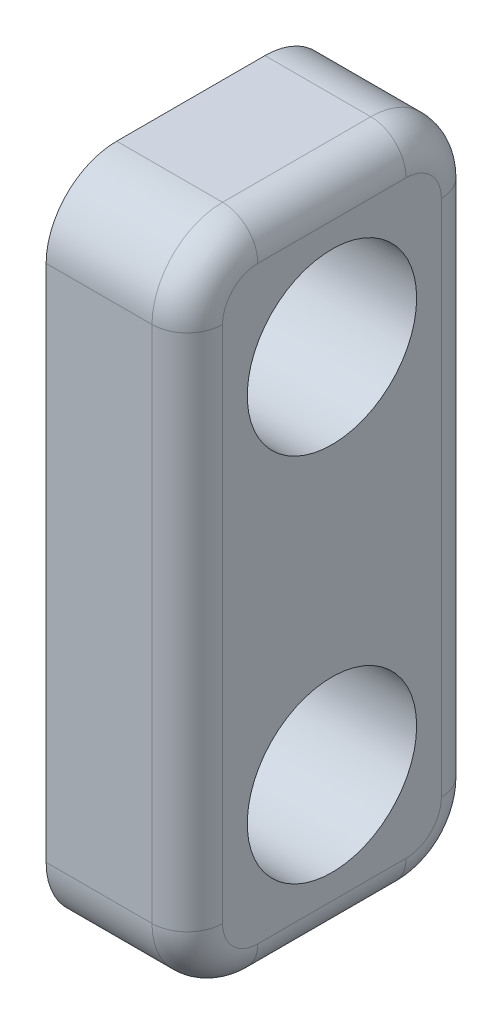
ISO-10303-21;
HEADER;
FILE_DESCRIPTION(('STEP AP214'),'2;1');
FILE_NAME('part.step','',(''),(''),'','','');
FILE_SCHEMA(('AUTOMOTIVE_DESIGN { 1 0 10303 214 1 1 1 1 }'));
ENDSEC;
DATA;
#1=APPLICATION_CONTEXT('core data for automotive mechanical design processes');
#2=APPLICATION_PROTOCOL_DEFINITION('international standard','automotive_design',2000,#1);
#3=PRODUCT_CONTEXT('',#1,'mechanical');
#4=PRODUCT('Part','Part','',(#3));
#5=PRODUCT_RELATED_PRODUCT_CATEGORY('part','',(#4));
#6=PRODUCT_DEFINITION_FORMATION('','',#4);
#7=PRODUCT_DEFINITION_CONTEXT('part definition',#1,'design');
#8=PRODUCT_DEFINITION('design','',#6,#7);
#9=PRODUCT_DEFINITION_SHAPE('','',#8);
#10=(LENGTH_UNIT() NAMED_UNIT(*) SI_UNIT(.MILLI.,.METRE.));
#11=(NAMED_UNIT(*) PLANE_ANGLE_UNIT() SI_UNIT($,.RADIAN.));
#12=(NAMED_UNIT(*) SI_UNIT($,.STERADIAN.) SOLID_ANGLE_UNIT());
#13=UNCERTAINTY_MEASURE_WITH_UNIT(LENGTH_MEASURE(1.E-05),#10,'distance_accuracy_value','');
#14=(GEOMETRIC_REPRESENTATION_CONTEXT(3) GLOBAL_UNCERTAINTY_ASSIGNED_CONTEXT((#13)) GLOBAL_UNIT_ASSIGNED_CONTEXT((#10,
#11,#12)) REPRESENTATION_CONTEXT('',''));
#15=CARTESIAN_POINT('',(0.,0.,0.));
#16=DIRECTION('',(0.,0.,1.));
#17=DIRECTION('',(1.,0.,0.));
#18=AXIS2_PLACEMENT_3D('',#15,#16,#17);
#19=CARTESIAN_POINT('',(-69.0290957761398,135.89197650815,0.442740883651495));
#20=DIRECTION('',(-1.,0.,-2.08166817117215E-13));
#21=DIRECTION('',(-2.08166817117215E-13,0.,1.));
#22=AXIS2_PLACEMENT_3D('',#19,#20,#21);
#23=TOROIDAL_SURFACE('',#22,1.00000000000001,0.99999999999995);
#24=CARTESIAN_POINT('',(-69.0290957761398,135.89197650815,0.442740883651457));
#25=DIRECTION('',(1.,0.,2.4757973449141E-13));
#26=DIRECTION('',(2.4757973449141E-13,0.,-1.));
#27=AXIS2_PLACEMENT_3D('',#24,#25,#26);
#28=CIRCLE('',#27,2.);
#29=CARTESIAN_POINT('',(-69.0290957761403,135.89197650815,2.44274088365146));
#30=VERTEX_POINT('',#29);
#31=CARTESIAN_POINT('',(-69.0290957761399,137.89197650815,0.442740883651085));
#32=VERTEX_POINT('',#31);
#33=EDGE_CURVE('E130',#30,#32,#28,.F.);
#34=ORIENTED_EDGE('',*,*,#33,.F.);
#35=CARTESIAN_POINT('',(-69.0290957761401,135.89197650815,1.44274088365146));
#36=DIRECTION('',(0.,-1.,0.));
#37=DIRECTION('',(1.,0.,0.));
#38=AXIS2_PLACEMENT_3D('',#35,#36,#37);
#39=CIRCLE('',#38,1.);
#40=CARTESIAN_POINT('',(-68.0290957761401,135.89197650815,1.4427408836517));
#41=VERTEX_POINT('',#40);
#42=EDGE_CURVE('E85',#41,#30,#39,.T.);
#43=ORIENTED_EDGE('',*,*,#42,.F.);
#44=CARTESIAN_POINT('',(-68.0290957761399,135.89197650815,0.442740883651703));
#45=DIRECTION('',(-1.,0.,-2.08166817117215E-13));
#46=DIRECTION('',(-2.08166817117215E-13,0.,1.));
#47=AXIS2_PLACEMENT_3D('',#44,#45,#46);
#48=CIRCLE('',#47,1.00000000000001);
#49=CARTESIAN_POINT('',(-68.0290957761399,136.89197650815,0.442740883651703));
#50=VERTEX_POINT('',#49);
#51=EDGE_CURVE('E21',#41,#50,#48,.T.);
#52=ORIENTED_EDGE('',*,*,#51,.T.);
#53=CARTESIAN_POINT('',(-69.0290957761399,136.89197650815,0.442740883651455));
#54=DIRECTION('',(-2.47817639425388E-13,0.,1.));
#55=DIRECTION('',(1.,0.,2.47817639425388E-13));
#56=AXIS2_PLACEMENT_3D('',#53,#54,#55);
#57=CIRCLE('',#56,1.);
#58=EDGE_CURVE('E90',#32,#50,#57,.F.);
#59=ORIENTED_EDGE('',*,*,#58,.F.);
#60=EDGE_LOOP('',(#34,#43,#52,#59));
#61=FACE_BOUND('',#60,.T.);
#62=ADVANCED_FACE('F17',(#61),#23,.T.);
#63=CARTESIAN_POINT('',(-69.029095776138,136.89197650815,-7.11415980814186));
#64=DIRECTION('',(-2.47817639425388E-13,0.,1.));
#65=DIRECTION('',(1.,0.,2.47817639425388E-13));
#66=AXIS2_PLACEMENT_3D('',#63,#64,#65);
#67=CYLINDRICAL_SURFACE('',#66,1.);
#68=ORIENTED_EDGE('',*,*,#58,.T.);
#69=DIRECTION('',(-2.47817639425388E-13,0.,1.));
#70=VECTOR('',#69,1.);
#71=CARTESIAN_POINT('',(-68.0290957761377,136.89197650815,-8.47106049993493));
#72=LINE('',#71,#70);
#73=CARTESIAN_POINT('',(-68.0290957761388,136.89197650815,-3.7572591163483));
#74=VERTEX_POINT('',#73);
#75=EDGE_CURVE('E95',#50,#74,#72,.F.);
#76=ORIENTED_EDGE('',*,*,#75,.T.);
#77=CARTESIAN_POINT('',(-69.0290957761388,136.89197650815,-3.75725911634855));
#78=DIRECTION('',(-2.4980018054066E-13,0.,1.));
#79=DIRECTION('',(1.,0.,2.4980018054066E-13));
#80=AXIS2_PLACEMENT_3D('',#77,#78,#79);
#81=CIRCLE('',#80,1.00000000000001);
#82=CARTESIAN_POINT('',(-69.0290957761391,137.89197650815,-3.75725911634855));
#83=VERTEX_POINT('',#82);
#84=EDGE_CURVE('E104',#74,#83,#81,.T.);
#85=ORIENTED_EDGE('',*,*,#84,.T.);
#86=DIRECTION('',(0.,0.,1.));
#87=VECTOR('',#86,1.);
#88=CARTESIAN_POINT('',(-69.0290957761399,137.89197650815,-5.75725911634929));
#89=LINE('',#88,#87);
#90=EDGE_CURVE('E102',#32,#83,#89,.F.);
#91=ORIENTED_EDGE('',*,*,#90,.F.);
#92=EDGE_LOOP('',(#68,#76,#85,#91));
#93=FACE_BOUND('',#92,.T.);
#94=ADVANCED_FACE('F98',(#93),#67,.T.);
#95=CARTESIAN_POINT('',(-69.0290957761387,135.89197650815,-3.75725911634849));
#96=DIRECTION('',(-1.,0.,-1.94289029309402E-13));
#97=DIRECTION('',(-1.94289029309402E-13,0.,1.));
#98=AXIS2_PLACEMENT_3D('',#95,#96,#97);
#99=TOROIDAL_SURFACE('',#98,1.00000000000008,1.00000000000001);
#100=CARTESIAN_POINT('',(-69.0290957761388,135.89197650815,-3.75725911634855));
#101=DIRECTION('',(1.,0.,2.4757973449141E-13));
#102=DIRECTION('',(2.4757973449141E-13,0.,-1.));
#103=AXIS2_PLACEMENT_3D('',#100,#101,#102);
#104=CIRCLE('',#103,2.);
#105=CARTESIAN_POINT('',(-69.0290957761383,135.89197650815,-5.75725911634855));
#106=VERTEX_POINT('',#105);
#107=EDGE_CURVE('E175',#83,#106,#104,.F.);
#108=ORIENTED_EDGE('',*,*,#107,.F.);
#109=ORIENTED_EDGE('',*,*,#84,.F.);
#110=CARTESIAN_POINT('',(-68.0290957761387,135.89197650815,-3.7572591163483));
#111=DIRECTION('',(-1.,0.,-1.94289029309402E-13));
#112=DIRECTION('',(-1.94289029309402E-13,0.,1.));
#113=AXIS2_PLACEMENT_3D('',#110,#111,#112);
#114=CIRCLE('',#113,0.999999999999987);
#115=CARTESIAN_POINT('',(-68.0290957761385,135.89197650815,-4.7572591163483));
#116=VERTEX_POINT('',#115);
#117=EDGE_CURVE('E110',#74,#116,#114,.T.);
#118=ORIENTED_EDGE('',*,*,#117,.T.);
#119=CARTESIAN_POINT('',(-69.0290957761385,135.89197650815,-4.75725911634855));
#120=DIRECTION('',(0.,1.,0.));
#121=DIRECTION('',(-1.,0.,0.));
#122=AXIS2_PLACEMENT_3D('',#119,#120,#121);
#123=CIRCLE('',#122,1.);
#124=EDGE_CURVE('E172',#106,#116,#123,.F.);
#125=ORIENTED_EDGE('',*,*,#124,.F.);
#126=EDGE_LOOP('',(#108,#109,#118,#125));
#127=FACE_BOUND('',#126,.T.);
#128=ADVANCED_FACE('F314',(#127),#99,.T.);
#129=CARTESIAN_POINT('',(-69.0290957761384,123.866968754454,-4.75725911634855));
#130=DIRECTION('',(0.,1.,0.));
#131=DIRECTION('',(-1.,0.,0.));
#132=AXIS2_PLACEMENT_3D('',#129,#130,#131);
#133=CYLINDRICAL_SURFACE('',#132,1.);
#134=ORIENTED_EDGE('',*,*,#124,.T.);
#135=DIRECTION('',(0.,1.,0.));
#136=VECTOR('',#135,1.);
#137=CARTESIAN_POINT('',(-68.0290957761385,128.541971339019,-4.7572591163483));
#138=LINE('',#137,#136);
#139=CARTESIAN_POINT('',(-68.0290957761384,121.191966169888,-4.7572591163483));
#140=VERTEX_POINT('',#139);
#141=EDGE_CURVE('E112',#116,#140,#138,.F.);
#142=ORIENTED_EDGE('',*,*,#141,.T.);
#143=CARTESIAN_POINT('',(-69.0290957761383,121.191966169888,-4.75725911634851));
#144=DIRECTION('',(0.,1.,0.));
#145=DIRECTION('',(1.,0.,2.08166817117228E-13));
#146=AXIS2_PLACEMENT_3D('',#143,#144,#145);
#147=CIRCLE('',#146,0.999999999999993);
#148=CARTESIAN_POINT('',(-69.0290957761382,121.191966169888,-5.75725911634854));
#149=VERTEX_POINT('',#148);
#150=EDGE_CURVE('E161',#140,#149,#147,.T.);
#151=ORIENTED_EDGE('',*,*,#150,.T.);
#152=DIRECTION('',(0.,1.,0.));
#153=VECTOR('',#152,1.);
#154=CARTESIAN_POINT('',(-69.0290957761383,119.191966169888,-5.75725911634855));
#155=LINE('',#154,#153);
#156=EDGE_CURVE('E164',#106,#149,#155,.F.);
#157=ORIENTED_EDGE('',*,*,#156,.F.);
#158=EDGE_LOOP('',(#134,#142,#151,#157));
#159=FACE_BOUND('',#158,.T.);
#160=ADVANCED_FACE('F226',(#159),#133,.T.);
#161=CARTESIAN_POINT('',(-69.0290957761386,121.191966169888,-3.75725911634851));
#162=DIRECTION('',(-1.,0.,-2.08166817117217E-13));
#163=DIRECTION('',(-2.08166817117217E-13,0.,1.));
#164=AXIS2_PLACEMENT_3D('',#161,#162,#163);
#165=TOROIDAL_SURFACE('',#164,1.,0.999999999999993);
#166=CARTESIAN_POINT('',(-69.0290957761386,121.191966169888,-3.75725911634855));
#167=DIRECTION('',(1.,0.,2.4757973449141E-13));
#168=DIRECTION('',(2.4757973449141E-13,0.,-1.));
#169=AXIS2_PLACEMENT_3D('',#166,#167,#168);
#170=CIRCLE('',#169,2.);
#171=CARTESIAN_POINT('',(-69.0290957761386,119.191966169888,-3.75725911634911));
#172=VERTEX_POINT('',#171);
#173=EDGE_CURVE('E153',#149,#172,#170,.F.);
#174=ORIENTED_EDGE('',*,*,#173,.F.);
#175=ORIENTED_EDGE('',*,*,#150,.F.);
#176=CARTESIAN_POINT('',(-68.0290957761386,121.191966169888,-3.7572591163483));
#177=DIRECTION('',(-1.,0.,-2.08166817117217E-13));
#178=DIRECTION('',(-2.08166817117217E-13,0.,1.));
#179=AXIS2_PLACEMENT_3D('',#176,#177,#178);
#180=CIRCLE('',#179,1.);
#181=CARTESIAN_POINT('',(-68.0290957761386,120.191966169888,-3.7572591163483));
#182=VERTEX_POINT('',#181);
#183=EDGE_CURVE('E220',#140,#182,#180,.T.);
#184=ORIENTED_EDGE('',*,*,#183,.T.);
#185=CARTESIAN_POINT('',(-69.0290957761386,120.191966169888,-3.75725911634855));
#186=DIRECTION('',(2.47817639425388E-13,0.,-1.));
#187=DIRECTION('',(-1.,0.,-2.47817639425388E-13));
#188=AXIS2_PLACEMENT_3D('',#185,#186,#187);
#189=CIRCLE('',#188,1.);
#190=EDGE_CURVE('E150',#172,#182,#189,.F.);
#191=ORIENTED_EDGE('',*,*,#190,.F.);
#192=EDGE_LOOP('',(#174,#175,#184,#191));
#193=FACE_BOUND('',#192,.T.);
#194=ADVANCED_FACE('F231',(#193),#165,.T.);
#195=CARTESIAN_POINT('',(-69.0290957761388,120.191966169888,-3.01415980814186));
#196=DIRECTION('',(2.47817639425388E-13,0.,-1.));
#197=DIRECTION('',(-1.,0.,-2.47817639425388E-13));
#198=AXIS2_PLACEMENT_3D('',#195,#196,#197);
#199=CYLINDRICAL_SURFACE('',#198,1.);
#200=CARTESIAN_POINT('',(-69.0290957761397,120.191966169888,0.442740883651447));
#201=DIRECTION('',(2.47957036847438E-13,0.,-1.));
#202=DIRECTION('',(1.,0.,2.47957036847438E-13));
#203=AXIS2_PLACEMENT_3D('',#200,#201,#202);
#204=CIRCLE('',#203,0.999999999999998);
#205=CARTESIAN_POINT('',(-68.0290957761397,120.191966169888,0.442740883651688));
#206=VERTEX_POINT('',#205);
#207=CARTESIAN_POINT('',(-69.0290957761394,119.191966169888,0.442740883651448));
#208=VERTEX_POINT('',#207);
#209=EDGE_CURVE('E139',#206,#208,#204,.T.);
#210=ORIENTED_EDGE('',*,*,#209,.T.);
#211=DIRECTION('',(0.,0.,1.));
#212=VECTOR('',#211,1.);
#213=CARTESIAN_POINT('',(-69.0290957761386,119.191966169888,2.44274088365071));
#214=LINE('',#213,#212);
#215=EDGE_CURVE('E142',#172,#208,#214,.T.);
#216=ORIENTED_EDGE('',*,*,#215,.F.);
#217=ORIENTED_EDGE('',*,*,#190,.T.);
#218=DIRECTION('',(-2.47817639425388E-13,0.,1.));
#219=VECTOR('',#218,1.);
#220=CARTESIAN_POINT('',(-68.0290957761375,120.191966169888,-8.47106049993493));
#221=LINE('',#220,#219);
#222=EDGE_CURVE('E219',#182,#206,#221,.T.);
#223=ORIENTED_EDGE('',*,*,#222,.T.);
#224=EDGE_LOOP('',(#210,#216,#217,#223));
#225=FACE_BOUND('',#224,.T.);
#226=ADVANCED_FACE('F235',(#225),#199,.T.);
#227=CARTESIAN_POINT('',(-69.0290957761397,121.191966169888,0.442740883651487));
#228=DIRECTION('',(-1.,0.,-1.94289029309403E-13));
#229=DIRECTION('',(-1.94289029309403E-13,0.,1.));
#230=AXIS2_PLACEMENT_3D('',#227,#228,#229);
#231=DEGENERATE_TOROIDAL_SURFACE('',#230,0.999999999999987,0.999999999999998,.T.);
#232=CARTESIAN_POINT('',(-68.0290957761397,121.191966169888,0.442740883651681));
#233=DIRECTION('',(-1.,0.,-1.94289029309403E-13));
#234=DIRECTION('',(-1.94289029309403E-13,0.,1.));
#235=AXIS2_PLACEMENT_3D('',#232,#233,#234);
#236=CIRCLE('',#235,0.999999999999987);
#237=CARTESIAN_POINT('',(-68.0290957761399,121.191966169888,1.4427408836517));
#238=VERTEX_POINT('',#237);
#239=EDGE_CURVE('E132',#206,#238,#236,.T.);
#240=ORIENTED_EDGE('',*,*,#239,.T.);
#241=CARTESIAN_POINT('',(-69.02909577614,121.191966169888,1.44274088365146));
#242=DIRECTION('',(0.,-1.,0.));
#243=DIRECTION('',(1.,0.,0.));
#244=AXIS2_PLACEMENT_3D('',#241,#242,#243);
#245=CIRCLE('',#244,1.);
#246=CARTESIAN_POINT('',(-69.0290957761402,121.191966169888,2.44274088365145));
#247=VERTEX_POINT('',#246);
#248=EDGE_CURVE('E117',#247,#238,#245,.F.);
#249=ORIENTED_EDGE('',*,*,#248,.F.);
#250=CARTESIAN_POINT('',(-69.0290957761397,121.191966169888,0.442740883651448));
#251=DIRECTION('',(1.,0.,2.4757973449141E-13));
#252=DIRECTION('',(2.4757973449141E-13,0.,-1.));
#253=AXIS2_PLACEMENT_3D('',#250,#251,#252);
#254=CIRCLE('',#253,2.);
#255=EDGE_CURVE('E118',#208,#247,#254,.F.);
#256=ORIENTED_EDGE('',*,*,#255,.F.);
#257=ORIENTED_EDGE('',*,*,#209,.F.);
#258=EDGE_LOOP('',(#240,#249,#256,#257));
#259=FACE_BOUND('',#258,.T.);
#260=ADVANCED_FACE('F19',(#259),#231,.T.);
#261=CARTESIAN_POINT('',(-69.0290957761401,133.216973923584,1.44274088365146));
#262=DIRECTION('',(0.,-1.,0.));
#263=DIRECTION('',(1.,0.,0.));
#264=AXIS2_PLACEMENT_3D('',#261,#262,#263);
#265=CYLINDRICAL_SURFACE('',#264,1.);
#266=ORIENTED_EDGE('',*,*,#248,.T.);
#267=DIRECTION('',(0.,1.,0.));
#268=VECTOR('',#267,1.);
#269=CARTESIAN_POINT('',(-68.0290957761401,128.541971339019,1.4427408836517));
#270=LINE('',#269,#268);
#271=EDGE_CURVE('E96',#238,#41,#270,.T.);
#272=ORIENTED_EDGE('',*,*,#271,.T.);
#273=ORIENTED_EDGE('',*,*,#42,.T.);
#274=DIRECTION('',(0.,1.,0.));
#275=VECTOR('',#274,1.);
#276=CARTESIAN_POINT('',(-69.0290957761402,137.89197650815,2.44274088365146));
#277=LINE('',#276,#275);
#278=EDGE_CURVE('E124',#247,#30,#277,.T.);
#279=ORIENTED_EDGE('',*,*,#278,.F.);
#280=EDGE_LOOP('',(#266,#272,#273,#279));
#281=FACE_BOUND('',#280,.T.);
#282=ADVANCED_FACE('F288',(#281),#265,.T.);
#283=CARTESIAN_POINT('',(-68.0290957761376,128.541971339019,-8.47106049993493));
#284=DIRECTION('',(-1.,0.,-2.47817639425388E-13));
#285=DIRECTION('',(-2.47817639425388E-13,0.,1.));
#286=AXIS2_PLACEMENT_3D('',#283,#284,#285);
#287=PLANE('',#286);
#288=CARTESIAN_POINT('',(-68.0290957761392,123.291966169888,-1.6572591163483));
#289=DIRECTION('',(1.,0.,2.4757973449141E-13));
#290=DIRECTION('',(2.4757973449141E-13,0.,-1.));
#291=AXIS2_PLACEMENT_3D('',#288,#289,#290);
#292=CIRCLE('',#291,2.4);
#293=CARTESIAN_POINT('',(-68.0290957761386,123.291966169888,-4.0572591163483));
#294=VERTEX_POINT('',#293);
#295=EDGE_CURVE('E214',#294,#294,#292,.F.);
#296=ORIENTED_EDGE('',*,*,#295,.T.);
#297=EDGE_LOOP('',(#296));
#298=FACE_BOUND('',#297,.T.);
#299=CARTESIAN_POINT('',(-68.0290957761393,133.79197650815,-1.6572591163483));
#300=DIRECTION('',(1.,0.,2.4757973449141E-13));
#301=DIRECTION('',(2.4757973449141E-13,0.,-1.));
#302=AXIS2_PLACEMENT_3D('',#299,#300,#301);
#303=CIRCLE('',#302,2.4);
#304=CARTESIAN_POINT('',(-68.0290957761387,133.79197650815,-4.0572591163483));
#305=VERTEX_POINT('',#304);
#306=EDGE_CURVE('E211',#305,#305,#303,.F.);
#307=ORIENTED_EDGE('',*,*,#306,.T.);
#308=EDGE_LOOP('',(#307));
#309=FACE_BOUND('',#308,.T.);
#310=ORIENTED_EDGE('',*,*,#222,.F.);
#311=ORIENTED_EDGE('',*,*,#183,.F.);
#312=ORIENTED_EDGE('',*,*,#141,.F.);
#313=ORIENTED_EDGE('',*,*,#117,.F.);
#314=ORIENTED_EDGE('',*,*,#75,.F.);
#315=ORIENTED_EDGE('',*,*,#51,.F.);
#316=ORIENTED_EDGE('',*,*,#271,.F.);
#317=ORIENTED_EDGE('',*,*,#239,.F.);
#318=EDGE_LOOP('',(#310,#311,#312,#313,#314,#315,#316,#317));
#319=FACE_BOUND('',#318,.T.);
#320=ADVANCED_FACE('F108',(#298,#309,#319),#287,.F.);
#321=CARTESIAN_POINT('',(-72.0290957761399,135.89197650815,0.442740883650714));
#322=DIRECTION('',(1.,0.,2.4757973449141E-13));
#323=DIRECTION('',(2.4757973449141E-13,0.,-1.));
#324=AXIS2_PLACEMENT_3D('',#321,#322,#323);
#325=CYLINDRICAL_SURFACE('',#324,2.);
#326=CARTESIAN_POINT('',(-72.0290957761399,135.89197650815,0.442740883650714));
#327=DIRECTION('',(1.,0.,2.4757973449141E-13));
#328=DIRECTION('',(2.4757973449141E-13,0.,-1.));
#329=AXIS2_PLACEMENT_3D('',#326,#327,#328);
#330=CIRCLE('',#329,2.);
#331=CARTESIAN_POINT('',(-72.0290957761404,135.89197650815,2.44274088365072));
#332=VERTEX_POINT('',#331);
#333=CARTESIAN_POINT('',(-72.0290957761399,137.89197650815,0.442740883650714));
#334=VERTEX_POINT('',#333);
#335=EDGE_CURVE('E208',#332,#334,#330,.F.);
#336=ORIENTED_EDGE('',*,*,#335,.F.);
#337=DIRECTION('',(1.,0.,2.4757973449141E-13));
#338=VECTOR('',#337,1.);
#339=CARTESIAN_POINT('',(-72.0290957761404,135.89197650815,2.44274088365072));
#340=LINE('',#339,#338);
#341=EDGE_CURVE('E127',#30,#332,#340,.F.);
#342=ORIENTED_EDGE('',*,*,#341,.F.);
#343=ORIENTED_EDGE('',*,*,#33,.T.);
#344=DIRECTION('',(-1.,0.,0.));
#345=VECTOR('',#344,1.);
#346=CARTESIAN_POINT('',(-72.0290957761383,137.89197650815,0.442740883650714));
#347=LINE('',#346,#345);
#348=EDGE_CURVE('E178',#334,#32,#347,.F.);
#349=ORIENTED_EDGE('',*,*,#348,.F.);
#350=EDGE_LOOP('',(#336,#342,#343,#349));
#351=FACE_BOUND('',#350,.T.);
#352=ADVANCED_FACE('F283',(#351),#325,.T.);
#353=CARTESIAN_POINT('',(-72.0290957761383,137.89197650815,-5.75725911634929));
#354=DIRECTION('',(0.,1.,0.));
#355=DIRECTION('',(-1.,0.,0.));
#356=AXIS2_PLACEMENT_3D('',#353,#354,#355);
#357=PLANE('',#356);
#358=DIRECTION('',(-2.47817639425388E-13,0.,1.));
#359=VECTOR('',#358,1.);
#360=CARTESIAN_POINT('',(-72.0290957761377,137.89197650815,-8.47106049993592));
#361=LINE('',#360,#359);
#362=CARTESIAN_POINT('',(-72.0290957761388,137.89197650815,-3.75725911634929));
#363=VERTEX_POINT('',#362);
#364=EDGE_CURVE('E207',#334,#363,#361,.F.);
#365=ORIENTED_EDGE('',*,*,#364,.F.);
#366=ORIENTED_EDGE('',*,*,#348,.T.);
#367=ORIENTED_EDGE('',*,*,#90,.T.);
#368=DIRECTION('',(1.,0.,2.4757973449141E-13));
#369=VECTOR('',#368,1.);
#370=CARTESIAN_POINT('',(-72.0290957761388,137.89197650815,-3.75725911634929));
#371=LINE('',#370,#369);
#372=EDGE_CURVE('E167',#363,#83,#371,.T.);
#373=ORIENTED_EDGE('',*,*,#372,.F.);
#374=EDGE_LOOP('',(#365,#366,#367,#373));
#375=FACE_BOUND('',#374,.T.);
#376=ADVANCED_FACE('F279',(#375),#357,.T.);
#377=CARTESIAN_POINT('',(-72.0290957761388,135.89197650815,-3.75725911634929));
#378=DIRECTION('',(1.,0.,2.4757973449141E-13));
#379=DIRECTION('',(2.4757973449141E-13,0.,-1.));
#380=AXIS2_PLACEMENT_3D('',#377,#378,#379);
#381=CYLINDRICAL_SURFACE('',#380,2.);
#382=CARTESIAN_POINT('',(-72.0290957761388,135.89197650815,-3.75725911634929));
#383=DIRECTION('',(1.,0.,2.4757973449141E-13));
#384=DIRECTION('',(2.4757973449141E-13,0.,-1.));
#385=AXIS2_PLACEMENT_3D('',#382,#383,#384);
#386=CIRCLE('',#385,2.);
#387=CARTESIAN_POINT('',(-72.0290957761383,135.89197650815,-5.75725911634929));
#388=VERTEX_POINT('',#387);
#389=EDGE_CURVE('E204',#363,#388,#386,.F.);
#390=ORIENTED_EDGE('',*,*,#389,.F.);
#391=ORIENTED_EDGE('',*,*,#372,.T.);
#392=ORIENTED_EDGE('',*,*,#107,.T.);
#393=DIRECTION('',(-1.,0.,-2.4757973449141E-13));
#394=VECTOR('',#393,1.);
#395=CARTESIAN_POINT('',(-72.0290957761381,135.89197650815,-5.75725911634929));
#396=LINE('',#395,#394);
#397=EDGE_CURVE('E156',#388,#106,#396,.F.);
#398=ORIENTED_EDGE('',*,*,#397,.F.);
#399=EDGE_LOOP('',(#390,#391,#392,#398));
#400=FACE_BOUND('',#399,.T.);
#401=ADVANCED_FACE('F317',(#400),#381,.T.);
#402=CARTESIAN_POINT('',(-72.0290957761381,119.191966169888,-5.75725911634929));
#403=DIRECTION('',(2.4757973449141E-13,0.,-1.));
#404=DIRECTION('',(-1.,0.,-2.4757973449141E-13));
#405=AXIS2_PLACEMENT_3D('',#402,#403,#404);
#406=PLANE('',#405);
#407=DIRECTION('',(0.,1.,0.));
#408=VECTOR('',#407,1.);
#409=CARTESIAN_POINT('',(-72.0290957761383,128.541971339019,-5.75725911634929));
#410=LINE('',#409,#408);
#411=CARTESIAN_POINT('',(-72.0290957761381,121.191966169888,-5.75725911634929));
#412=VERTEX_POINT('',#411);
#413=EDGE_CURVE('E203',#388,#412,#410,.F.);
#414=ORIENTED_EDGE('',*,*,#413,.F.);
#415=ORIENTED_EDGE('',*,*,#397,.T.);
#416=ORIENTED_EDGE('',*,*,#156,.T.);
#417=DIRECTION('',(1.,0.,2.4757973449141E-13));
#418=VECTOR('',#417,1.);
#419=CARTESIAN_POINT('',(-72.0290957761382,121.191966169888,-5.75725911634929));
#420=LINE('',#419,#418);
#421=EDGE_CURVE('E145',#412,#149,#420,.T.);
#422=ORIENTED_EDGE('',*,*,#421,.F.);
#423=EDGE_LOOP('',(#414,#415,#416,#422));
#424=FACE_BOUND('',#423,.T.);
#425=ADVANCED_FACE('F319',(#424),#406,.T.);
#426=CARTESIAN_POINT('',(-72.0290957761387,121.191966169888,-3.75725911634929));
#427=DIRECTION('',(1.,0.,2.4757973449141E-13));
#428=DIRECTION('',(2.4757973449141E-13,0.,-1.));
#429=AXIS2_PLACEMENT_3D('',#426,#427,#428);
#430=CYLINDRICAL_SURFACE('',#429,2.);
#431=CARTESIAN_POINT('',(-72.0290957761386,121.191966169888,-3.75725911634929));
#432=DIRECTION('',(1.,0.,2.4757973449141E-13));
#433=DIRECTION('',(2.4757973449141E-13,0.,-1.));
#434=AXIS2_PLACEMENT_3D('',#431,#432,#433);
#435=CIRCLE('',#434,2.);
#436=CARTESIAN_POINT('',(-72.0290957761386,119.191966169888,-3.75725911634929));
#437=VERTEX_POINT('',#436);
#438=EDGE_CURVE('E200',#412,#437,#435,.F.);
#439=ORIENTED_EDGE('',*,*,#438,.F.);
#440=ORIENTED_EDGE('',*,*,#421,.T.);
#441=ORIENTED_EDGE('',*,*,#173,.T.);
#442=DIRECTION('',(1.,0.,0.));
#443=VECTOR('',#442,1.);
#444=CARTESIAN_POINT('',(-72.0290957761402,119.191966169888,-3.75725911634929));
#445=LINE('',#444,#443);
#446=EDGE_CURVE('E121',#437,#172,#445,.T.);
#447=ORIENTED_EDGE('',*,*,#446,.F.);
#448=EDGE_LOOP('',(#439,#440,#441,#447));
#449=FACE_BOUND('',#448,.T.);
#450=ADVANCED_FACE('F306',(#449),#430,.T.);
#451=CARTESIAN_POINT('',(-72.0290957761402,119.191966169888,2.44274088365071));
#452=DIRECTION('',(0.,-1.,0.));
#453=DIRECTION('',(1.,0.,0.));
#454=AXIS2_PLACEMENT_3D('',#451,#452,#453);
#455=PLANE('',#454);
#456=DIRECTION('',(-2.47817639425388E-13,0.,1.));
#457=VECTOR('',#456,1.);
#458=CARTESIAN_POINT('',(-72.0290957761375,119.191966169888,-8.47106049993592));
#459=LINE('',#458,#457);
#460=CARTESIAN_POINT('',(-72.0290957761397,119.191966169888,0.442740883650705));
#461=VERTEX_POINT('',#460);
#462=EDGE_CURVE('E199',#437,#461,#459,.T.);
#463=ORIENTED_EDGE('',*,*,#462,.F.);
#464=ORIENTED_EDGE('',*,*,#446,.T.);
#465=ORIENTED_EDGE('',*,*,#215,.T.);
#466=DIRECTION('',(1.,0.,2.4757973449141E-13));
#467=VECTOR('',#466,1.);
#468=CARTESIAN_POINT('',(-72.0290957761397,119.191966169888,0.442740883650705));
#469=LINE('',#468,#467);
#470=EDGE_CURVE('E120',#461,#208,#469,.T.);
#471=ORIENTED_EDGE('',*,*,#470,.F.);
#472=EDGE_LOOP('',(#463,#464,#465,#471));
#473=FACE_BOUND('',#472,.T.);
#474=ADVANCED_FACE('F249',(#473),#455,.T.);
#475=CARTESIAN_POINT('',(-72.0290957761397,121.191966169888,0.442740883650705));
#476=DIRECTION('',(1.,0.,2.4757973449141E-13));
#477=DIRECTION('',(2.4757973449141E-13,0.,-1.));
#478=AXIS2_PLACEMENT_3D('',#475,#476,#477);
#479=CYLINDRICAL_SURFACE('',#478,2.);
#480=CARTESIAN_POINT('',(-72.0290957761397,121.191966169888,0.442740883650705));
#481=DIRECTION('',(1.,0.,2.4757973449141E-13));
#482=DIRECTION('',(2.4757973449141E-13,0.,-1.));
#483=AXIS2_PLACEMENT_3D('',#480,#481,#482);
#484=CIRCLE('',#483,2.);
#485=CARTESIAN_POINT('',(-72.0290957761402,121.191966169888,2.44274088365071));
#486=VERTEX_POINT('',#485);
#487=EDGE_CURVE('E196',#461,#486,#484,.F.);
#488=ORIENTED_EDGE('',*,*,#487,.F.);
#489=ORIENTED_EDGE('',*,*,#470,.T.);
#490=ORIENTED_EDGE('',*,*,#255,.T.);
#491=DIRECTION('',(1.,0.,2.4757973449141E-13));
#492=VECTOR('',#491,1.);
#493=CARTESIAN_POINT('',(-72.0290957761404,121.191966169888,2.44274088365071));
#494=LINE('',#493,#492);
#495=EDGE_CURVE('E36',#486,#247,#494,.T.);
#496=ORIENTED_EDGE('',*,*,#495,.F.);
#497=EDGE_LOOP('',(#488,#489,#490,#496));
#498=FACE_BOUND('',#497,.T.);
#499=ADVANCED_FACE('F250',(#498),#479,.T.);
#500=CARTESIAN_POINT('',(-72.0290957761404,137.89197650815,2.44274088365072));
#501=DIRECTION('',(-2.4757973449141E-13,0.,1.));
#502=DIRECTION('',(1.,0.,2.4757973449141E-13));
#503=AXIS2_PLACEMENT_3D('',#500,#501,#502);
#504=PLANE('',#503);
#505=DIRECTION('',(0.,1.,0.));
#506=VECTOR('',#505,1.);
#507=CARTESIAN_POINT('',(-72.0290957761403,128.541971339019,2.44274088365071));
#508=LINE('',#507,#506);
#509=EDGE_CURVE('E195',#486,#332,#508,.T.);
#510=ORIENTED_EDGE('',*,*,#509,.F.);
#511=ORIENTED_EDGE('',*,*,#495,.T.);
#512=ORIENTED_EDGE('',*,*,#278,.T.);
#513=ORIENTED_EDGE('',*,*,#341,.T.);
#514=EDGE_LOOP('',(#510,#511,#512,#513));
#515=FACE_BOUND('',#514,.T.);
#516=ADVANCED_FACE('F291',(#515),#504,.T.);
#517=CARTESIAN_POINT('',(-72.0290957761392,123.291966169888,-1.65725911634929));
#518=DIRECTION('',(1.,0.,2.4757973449141E-13));
#519=DIRECTION('',(2.4757973449141E-13,0.,-1.));
#520=AXIS2_PLACEMENT_3D('',#517,#518,#519);
#521=CYLINDRICAL_SURFACE('',#520,2.4);
#522=CARTESIAN_POINT('',(-72.0290957761392,123.291966169888,-1.65725911634929));
#523=DIRECTION('',(1.,0.,2.4757973449141E-13));
#524=DIRECTION('',(2.4757973449141E-13,0.,-1.));
#525=AXIS2_PLACEMENT_3D('',#522,#523,#524);
#526=CIRCLE('',#525,2.4);
#527=CARTESIAN_POINT('',(-72.0290957761386,123.291966169888,-4.05725911634929));
#528=VERTEX_POINT('',#527);
#529=EDGE_CURVE('E27',#528,#528,#526,.T.);
#530=ORIENTED_EDGE('',*,*,#529,.F.);
#531=EDGE_LOOP('',(#530));
#532=FACE_BOUND('',#531,.T.);
#533=ORIENTED_EDGE('',*,*,#295,.F.);
#534=EDGE_LOOP('',(#533));
#535=FACE_BOUND('',#534,.T.);
#536=ADVANCED_FACE('F336',(#532,#535),#521,.F.);
#537=CARTESIAN_POINT('',(-72.0290957761393,133.79197650815,-1.65725911634929));
#538=DIRECTION('',(1.,0.,2.4757973449141E-13));
#539=DIRECTION('',(2.4757973449141E-13,0.,-1.));
#540=AXIS2_PLACEMENT_3D('',#537,#538,#539);
#541=CYLINDRICAL_SURFACE('',#540,2.4);
#542=CARTESIAN_POINT('',(-72.0290957761393,133.79197650815,-1.65725911634929));
#543=DIRECTION('',(1.,0.,2.4757973449141E-13));
#544=DIRECTION('',(2.4757973449141E-13,0.,-1.));
#545=AXIS2_PLACEMENT_3D('',#542,#543,#544);
#546=CIRCLE('',#545,2.4);
#547=CARTESIAN_POINT('',(-72.0290957761387,133.79197650815,-4.05725911634929));
#548=VERTEX_POINT('',#547);
#549=EDGE_CURVE('E11',#548,#548,#546,.T.);
#550=ORIENTED_EDGE('',*,*,#549,.F.);
#551=EDGE_LOOP('',(#550));
#552=FACE_BOUND('',#551,.T.);
#553=ORIENTED_EDGE('',*,*,#306,.F.);
#554=EDGE_LOOP('',(#553));
#555=FACE_BOUND('',#554,.T.);
#556=ADVANCED_FACE('F330',(#552,#555),#541,.F.);
#557=CARTESIAN_POINT('',(-72.0290957761376,128.541971339019,-8.47106049993592));
#558=DIRECTION('',(-1.,0.,-2.47817639425388E-13));
#559=DIRECTION('',(-2.47817639425388E-13,0.,1.));
#560=AXIS2_PLACEMENT_3D('',#557,#558,#559);
#561=PLANE('',#560);
#562=ORIENTED_EDGE('',*,*,#549,.T.);
#563=EDGE_LOOP('',(#562));
#564=FACE_BOUND('',#563,.T.);
#565=ORIENTED_EDGE('',*,*,#529,.T.);
#566=EDGE_LOOP('',(#565));
#567=FACE_BOUND('',#566,.T.);
#568=ORIENTED_EDGE('',*,*,#487,.T.);
#569=ORIENTED_EDGE('',*,*,#509,.T.);
#570=ORIENTED_EDGE('',*,*,#335,.T.);
#571=ORIENTED_EDGE('',*,*,#364,.T.);
#572=ORIENTED_EDGE('',*,*,#389,.T.);
#573=ORIENTED_EDGE('',*,*,#413,.T.);
#574=ORIENTED_EDGE('',*,*,#438,.T.);
#575=ORIENTED_EDGE('',*,*,#462,.T.);
#576=EDGE_LOOP('',(#568,#569,#570,#571,#572,#573,#574,#575));
#577=FACE_BOUND('',#576,.T.);
#578=ADVANCED_FACE('F302',(#564,#567,#577),#561,.T.);
#579=CLOSED_SHELL('',(#62,#94,#128,#160,#194,#226,#260,#282,#320,#352,#376,#401,#425,#450,#474,
#499,#516,#536,#556,#578));
#580=MANIFOLD_SOLID_BREP('B1',#579);
#581=ADVANCED_BREP_SHAPE_REPRESENTATION('',(#18,#580),#14);
#582=SHAPE_DEFINITION_REPRESENTATION(#9,#581);
ENDSEC;
END-ISO-10303-21;
